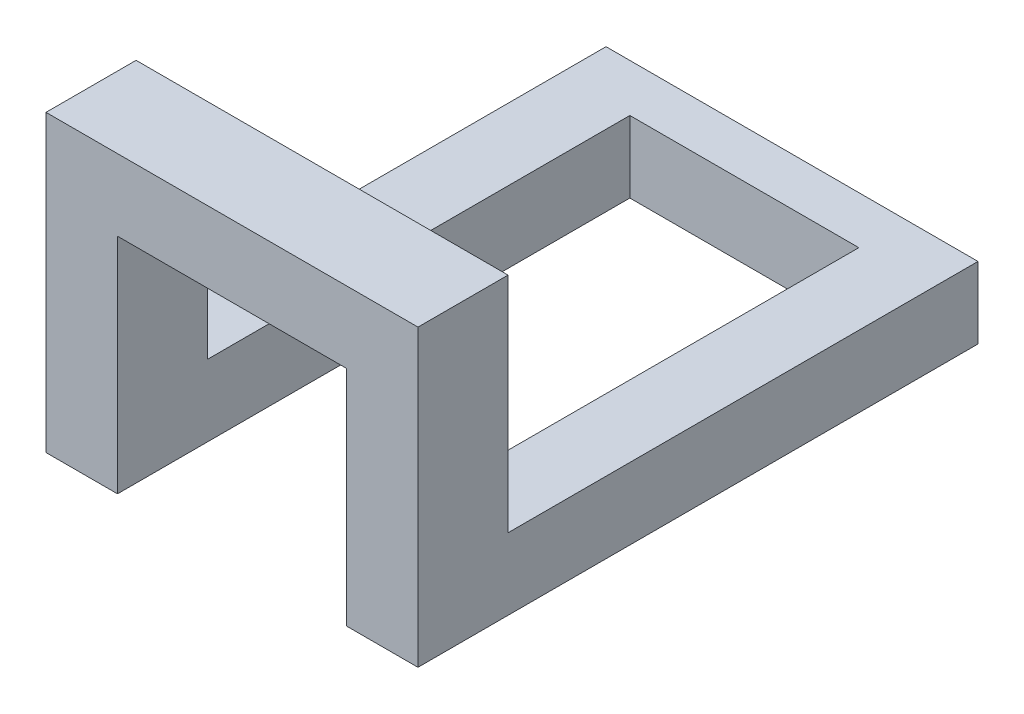
ISO-10303-21;
HEADER;
FILE_DESCRIPTION(('STEP AP214'),'2;1');
FILE_NAME('part.step','',(''),(''),'','','');
FILE_SCHEMA(('AUTOMOTIVE_DESIGN { 1 0 10303 214 1 1 1 1 }'));
ENDSEC;
DATA;
#1=APPLICATION_CONTEXT('core data for automotive mechanical design processes');
#2=APPLICATION_PROTOCOL_DEFINITION('international standard','automotive_design',2000,#1);
#3=PRODUCT_CONTEXT('',#1,'mechanical');
#4=PRODUCT('Part','Part','',(#3));
#5=PRODUCT_RELATED_PRODUCT_CATEGORY('part','',(#4));
#6=PRODUCT_DEFINITION_FORMATION('','',#4);
#7=PRODUCT_DEFINITION_CONTEXT('part definition',#1,'design');
#8=PRODUCT_DEFINITION('design','',#6,#7);
#9=PRODUCT_DEFINITION_SHAPE('','',#8);
#10=(LENGTH_UNIT() NAMED_UNIT(*) SI_UNIT(.MILLI.,.METRE.));
#11=(NAMED_UNIT(*) PLANE_ANGLE_UNIT() SI_UNIT($,.RADIAN.));
#12=(NAMED_UNIT(*) SI_UNIT($,.STERADIAN.) SOLID_ANGLE_UNIT());
#13=UNCERTAINTY_MEASURE_WITH_UNIT(LENGTH_MEASURE(1.E-05),#10,'distance_accuracy_value','');
#14=(GEOMETRIC_REPRESENTATION_CONTEXT(3) GLOBAL_UNCERTAINTY_ASSIGNED_CONTEXT((#13)) GLOBAL_UNIT_ASSIGNED_CONTEXT((#10,
#11,#12)) REPRESENTATION_CONTEXT('',''));
#15=CARTESIAN_POINT('',(0.,0.,0.));
#16=DIRECTION('',(0.,0.,1.));
#17=DIRECTION('',(1.,0.,0.));
#18=AXIS2_PLACEMENT_3D('',#15,#16,#17);
#19=CARTESIAN_POINT('',(24.4702529272949,3.81,-14.9470824608488));
#20=DIRECTION('',(0.,0.,-1.));
#21=DIRECTION('',(-1.,0.,0.));
#22=AXIS2_PLACEMENT_3D('',#19,#20,#21);
#23=PLANE('',#22);
#24=DIRECTION('',(0.,1.,0.));
#25=VECTOR('',#24,1.);
#26=CARTESIAN_POINT('',(28.2802529272949,-18.0183031909331,-14.9470824608488));
#27=LINE('',#26,#25);
#28=CARTESIAN_POINT('',(28.2802529272949,-8.08000000000004,-14.9470824608488));
#29=VERTEX_POINT('',#28);
#30=CARTESIAN_POINT('',(28.2802529272949,0.,-14.9470824608488));
#31=VERTEX_POINT('',#30);
#32=EDGE_CURVE('E195',#29,#31,#27,.T.);
#33=ORIENTED_EDGE('',*,*,#32,.F.);
#34=DIRECTION('',(1.,0.,0.));
#35=VECTOR('',#34,1.);
#36=CARTESIAN_POINT('',(28.2802529272949,-8.08000000000004,-14.9470824608488));
#37=LINE('',#36,#35);
#38=CARTESIAN_POINT('',(24.4702529272949,-8.08000000000004,-14.9470824608488));
#39=VERTEX_POINT('',#38);
#40=EDGE_CURVE('E162',#39,#29,#37,.T.);
#41=ORIENTED_EDGE('',*,*,#40,.F.);
#42=DIRECTION('',(0.,-1.,0.));
#43=VECTOR('',#42,1.);
#44=CARTESIAN_POINT('',(24.4702529272949,3.81,-14.9470824608488));
#45=LINE('',#44,#43);
#46=CARTESIAN_POINT('',(24.4702529272949,3.81,-14.9470824608488));
#47=VERTEX_POINT('',#46);
#48=EDGE_CURVE('E40',#47,#39,#45,.T.);
#49=ORIENTED_EDGE('',*,*,#48,.F.);
#50=DIRECTION('',(1.,0.,0.));
#51=VECTOR('',#50,1.);
#52=CARTESIAN_POINT('',(24.4702529272949,3.81,-14.9470824608488));
#53=LINE('',#52,#51);
#54=CARTESIAN_POINT('',(44.2902529272949,3.81,-14.9470824608488));
#55=VERTEX_POINT('',#54);
#56=EDGE_CURVE('E209',#47,#55,#53,.T.);
#57=ORIENTED_EDGE('',*,*,#56,.T.);
#58=DIRECTION('',(0.,-1.,0.));
#59=VECTOR('',#58,1.);
#60=CARTESIAN_POINT('',(44.2902529272949,3.81,-14.9470824608488));
#61=LINE('',#60,#59);
#62=CARTESIAN_POINT('',(44.2902529272949,-8.08000000000004,-14.9470824608488));
#63=VERTEX_POINT('',#62);
#64=EDGE_CURVE('E220',#55,#63,#61,.T.);
#65=ORIENTED_EDGE('',*,*,#64,.T.);
#66=DIRECTION('',(1.,0.,0.));
#67=VECTOR('',#66,1.);
#68=CARTESIAN_POINT('',(44.2902529272949,-8.08000000000004,-14.9470824608488));
#69=LINE('',#68,#67);
#70=CARTESIAN_POINT('',(40.4802529272949,-8.08000000000004,-14.9470824608488));
#71=VERTEX_POINT('',#70);
#72=EDGE_CURVE('E53',#71,#63,#69,.T.);
#73=ORIENTED_EDGE('',*,*,#72,.F.);
#74=DIRECTION('',(0.,1.,0.));
#75=VECTOR('',#74,1.);
#76=CARTESIAN_POINT('',(40.4802529272949,-18.0183031909331,-14.9470824608488));
#77=LINE('',#76,#75);
#78=CARTESIAN_POINT('',(40.4802529272949,0.,-14.9470824608488));
#79=VERTEX_POINT('',#78);
#80=EDGE_CURVE('E189',#71,#79,#77,.T.);
#81=ORIENTED_EDGE('',*,*,#80,.T.);
#82=DIRECTION('',(1.,0.,0.));
#83=VECTOR('',#82,1.);
#84=CARTESIAN_POINT('',(24.4702529272949,0.,-14.9470824608488));
#85=LINE('',#84,#83);
#86=EDGE_CURVE('E205',#31,#79,#85,.T.);
#87=ORIENTED_EDGE('',*,*,#86,.F.);
#88=EDGE_LOOP('',(#33,#41,#49,#57,#65,#73,#81,#87));
#89=FACE_BOUND('',#88,.T.);
#90=ADVANCED_FACE('F36',(#89),#23,.T.);
#91=CARTESIAN_POINT('',(0.,0.,0.));
#92=DIRECTION('',(0.,-1.,0.));
#93=DIRECTION('',(0.,0.,-1.));
#94=AXIS2_PLACEMENT_3D('',#91,#92,#93);
#95=PLANE('',#94);
#96=ORIENTED_EDGE('',*,*,#86,.T.);
#97=DIRECTION('',(0.,0.,-1.));
#98=VECTOR('',#97,1.);
#99=CARTESIAN_POINT('',(40.4802529272949,0.,-14.9470824608488));
#100=LINE('',#99,#98);
#101=CARTESIAN_POINT('',(40.4802529272949,0.,-10.1470824608488));
#102=VERTEX_POINT('',#101);
#103=EDGE_CURVE('E61',#102,#79,#100,.T.);
#104=ORIENTED_EDGE('',*,*,#103,.F.);
#105=DIRECTION('',(-1.,0.,0.));
#106=VECTOR('',#105,1.);
#107=CARTESIAN_POINT('',(44.2902529272949,0.,-10.1470824608488));
#108=LINE('',#107,#106);
#109=CARTESIAN_POINT('',(28.2802529272949,0.,-10.1470824608488));
#110=VERTEX_POINT('',#109);
#111=EDGE_CURVE('E210',#102,#110,#108,.T.);
#112=ORIENTED_EDGE('',*,*,#111,.T.);
#113=DIRECTION('',(0.,0.,1.));
#114=VECTOR('',#113,1.);
#115=CARTESIAN_POINT('',(28.2802529272949,0.,-10.1470824608488));
#116=LINE('',#115,#114);
#117=EDGE_CURVE('E136',#31,#110,#116,.T.);
#118=ORIENTED_EDGE('',*,*,#117,.F.);
#119=EDGE_LOOP('',(#96,#104,#112,#118));
#120=FACE_BOUND('',#119,.T.);
#121=ADVANCED_FACE('F240',(#120),#95,.T.);
#122=CARTESIAN_POINT('',(24.4702529272949,3.81,-10.1470824608488));
#123=DIRECTION('',(-1.,0.,0.));
#124=DIRECTION('',(0.,0.,1.));
#125=AXIS2_PLACEMENT_3D('',#122,#123,#124);
#126=PLANE('',#125);
#127=ORIENTED_EDGE('',*,*,#48,.T.);
#128=DIRECTION('',(0.,0.,1.));
#129=VECTOR('',#128,1.);
#130=CARTESIAN_POINT('',(24.4702529272949,-8.08000000000004,-42.8352361334903));
#131=LINE('',#130,#129);
#132=CARTESIAN_POINT('',(24.4702529272949,-8.08000000000004,-39.9870824608488));
#133=VERTEX_POINT('',#132);
#134=EDGE_CURVE('E168',#133,#39,#131,.T.);
#135=ORIENTED_EDGE('',*,*,#134,.F.);
#136=DIRECTION('',(0.,1.,0.));
#137=VECTOR('',#136,1.);
#138=CARTESIAN_POINT('',(24.4702529272949,-8.08000000000004,-39.9870824608488));
#139=LINE('',#138,#137);
#140=CARTESIAN_POINT('',(24.4702529272949,-11.89,-39.9870824608488));
#141=VERTEX_POINT('',#140);
#142=EDGE_CURVE('E148',#141,#133,#139,.T.);
#143=ORIENTED_EDGE('',*,*,#142,.F.);
#144=DIRECTION('',(0.,0.,-1.));
#145=VECTOR('',#144,1.);
#146=CARTESIAN_POINT('',(24.4702529272949,-11.89,-10.1470824608488));
#147=LINE('',#146,#145);
#148=CARTESIAN_POINT('',(24.4702529272949,-11.89,-10.1470824608488));
#149=VERTEX_POINT('',#148);
#150=EDGE_CURVE('E144',#149,#141,#147,.T.);
#151=ORIENTED_EDGE('',*,*,#150,.F.);
#152=DIRECTION('',(0.,-1.,0.));
#153=VECTOR('',#152,1.);
#154=CARTESIAN_POINT('',(24.4702529272949,3.81,-10.1470824608488));
#155=LINE('',#154,#153);
#156=CARTESIAN_POINT('',(24.4702529272949,3.81,-10.1470824608488));
#157=VERTEX_POINT('',#156);
#158=EDGE_CURVE('E11',#157,#149,#155,.T.);
#159=ORIENTED_EDGE('',*,*,#158,.F.);
#160=DIRECTION('',(0.,0.,-1.));
#161=VECTOR('',#160,1.);
#162=CARTESIAN_POINT('',(24.4702529272949,3.81,-10.1470824608488));
#163=LINE('',#162,#161);
#164=EDGE_CURVE('E206',#157,#47,#163,.T.);
#165=ORIENTED_EDGE('',*,*,#164,.T.);
#166=EDGE_LOOP('',(#127,#135,#143,#151,#159,#165));
#167=FACE_BOUND('',#166,.T.);
#168=ADVANCED_FACE('F38',(#167),#126,.T.);
#169=CARTESIAN_POINT('',(44.2902529272949,3.81,-10.1470824608488));
#170=DIRECTION('',(0.,0.,1.));
#171=DIRECTION('',(1.,0.,0.));
#172=AXIS2_PLACEMENT_3D('',#169,#170,#171);
#173=PLANE('',#172);
#174=ORIENTED_EDGE('',*,*,#111,.F.);
#175=DIRECTION('',(0.,1.,0.));
#176=VECTOR('',#175,1.);
#177=CARTESIAN_POINT('',(40.4802529272949,-18.0183031909331,-10.1470824608488));
#178=LINE('',#177,#176);
#179=CARTESIAN_POINT('',(40.4802529272949,-11.89,-10.1470824608488));
#180=VERTEX_POINT('',#179);
#181=EDGE_CURVE('E186',#180,#102,#178,.T.);
#182=ORIENTED_EDGE('',*,*,#181,.F.);
#183=DIRECTION('',(-1.,0.,0.));
#184=VECTOR('',#183,1.);
#185=CARTESIAN_POINT('',(44.2902529272949,-11.89,-10.1470824608488));
#186=LINE('',#185,#184);
#187=CARTESIAN_POINT('',(44.2902529272949,-11.89,-10.1470824608488));
#188=VERTEX_POINT('',#187);
#189=EDGE_CURVE('E137',#188,#180,#186,.T.);
#190=ORIENTED_EDGE('',*,*,#189,.F.);
#191=DIRECTION('',(0.,-1.,0.));
#192=VECTOR('',#191,1.);
#193=CARTESIAN_POINT('',(44.2902529272949,3.81,-10.1470824608488));
#194=LINE('',#193,#192);
#195=CARTESIAN_POINT('',(44.2902529272949,3.81,-10.1470824608488));
#196=VERTEX_POINT('',#195);
#197=EDGE_CURVE('E45',#196,#188,#194,.T.);
#198=ORIENTED_EDGE('',*,*,#197,.F.);
#199=DIRECTION('',(-1.,0.,0.));
#200=VECTOR('',#199,1.);
#201=CARTESIAN_POINT('',(44.2902529272949,3.81,-10.1470824608488));
#202=LINE('',#201,#200);
#203=EDGE_CURVE('E215',#196,#157,#202,.T.);
#204=ORIENTED_EDGE('',*,*,#203,.T.);
#205=ORIENTED_EDGE('',*,*,#158,.T.);
#206=DIRECTION('',(-1.,0.,0.));
#207=VECTOR('',#206,1.);
#208=CARTESIAN_POINT('',(24.4702529272949,-11.89,-10.1470824608488));
#209=LINE('',#208,#207);
#210=CARTESIAN_POINT('',(28.2802529272949,-11.89,-10.1470824608488));
#211=VERTEX_POINT('',#210);
#212=EDGE_CURVE('E197',#211,#149,#209,.T.);
#213=ORIENTED_EDGE('',*,*,#212,.F.);
#214=DIRECTION('',(0.,1.,0.));
#215=VECTOR('',#214,1.);
#216=CARTESIAN_POINT('',(28.2802529272949,-18.0183031909331,-10.1470824608488));
#217=LINE('',#216,#215);
#218=EDGE_CURVE('E200',#211,#110,#217,.T.);
#219=ORIENTED_EDGE('',*,*,#218,.T.);
#220=EDGE_LOOP('',(#174,#182,#190,#198,#204,#205,#213,#219));
#221=FACE_BOUND('',#220,.T.);
#222=ADVANCED_FACE('F250',(#221),#173,.T.);
#223=CARTESIAN_POINT('',(44.2902529272949,3.81,-10.1470824608488));
#224=DIRECTION('',(-1.,0.,0.));
#225=DIRECTION('',(0.,0.,1.));
#226=AXIS2_PLACEMENT_3D('',#223,#224,#225);
#227=PLANE('',#226);
#228=ORIENTED_EDGE('',*,*,#197,.T.);
#229=DIRECTION('',(0.,0.,1.));
#230=VECTOR('',#229,1.);
#231=CARTESIAN_POINT('',(44.2902529272949,-11.89,-14.9470824608488));
#232=LINE('',#231,#230);
#233=CARTESIAN_POINT('',(44.2902529272949,-11.89,-39.9870824608488));
#234=VERTEX_POINT('',#233);
#235=EDGE_CURVE('E127',#234,#188,#232,.T.);
#236=ORIENTED_EDGE('',*,*,#235,.F.);
#237=DIRECTION('',(0.,-1.,0.));
#238=VECTOR('',#237,1.);
#239=CARTESIAN_POINT('',(44.2902529272949,-8.08000000000004,-39.9870824608488));
#240=LINE('',#239,#238);
#241=CARTESIAN_POINT('',(44.2902529272949,-8.08000000000004,-39.9870824608488));
#242=VERTEX_POINT('',#241);
#243=EDGE_CURVE('E132',#242,#234,#240,.T.);
#244=ORIENTED_EDGE('',*,*,#243,.F.);
#245=DIRECTION('',(0.,0.,1.));
#246=VECTOR('',#245,1.);
#247=CARTESIAN_POINT('',(44.2902529272949,-8.08000000000004,-42.8352361334903));
#248=LINE('',#247,#246);
#249=EDGE_CURVE('E179',#242,#63,#248,.T.);
#250=ORIENTED_EDGE('',*,*,#249,.T.);
#251=ORIENTED_EDGE('',*,*,#64,.F.);
#252=DIRECTION('',(0.,0.,-1.));
#253=VECTOR('',#252,1.);
#254=CARTESIAN_POINT('',(44.2902529272949,3.81,-10.1470824608488));
#255=LINE('',#254,#253);
#256=EDGE_CURVE('E213',#196,#55,#255,.T.);
#257=ORIENTED_EDGE('',*,*,#256,.F.);
#258=EDGE_LOOP('',(#228,#236,#244,#250,#251,#257));
#259=FACE_BOUND('',#258,.T.);
#260=ADVANCED_FACE('F129',(#259),#227,.F.);
#261=CARTESIAN_POINT('',(0.,3.81,0.));
#262=DIRECTION('',(0.,-1.,0.));
#263=DIRECTION('',(0.,0.,-1.));
#264=AXIS2_PLACEMENT_3D('',#261,#262,#263);
#265=PLANE('',#264);
#266=ORIENTED_EDGE('',*,*,#164,.F.);
#267=ORIENTED_EDGE('',*,*,#203,.F.);
#268=ORIENTED_EDGE('',*,*,#256,.T.);
#269=ORIENTED_EDGE('',*,*,#56,.F.);
#270=EDGE_LOOP('',(#266,#267,#268,#269));
#271=FACE_BOUND('',#270,.T.);
#272=ADVANCED_FACE('F229',(#271),#265,.F.);
#273=CARTESIAN_POINT('',(28.2802529272949,-18.0183031909331,-10.1470824608488));
#274=DIRECTION('',(-1.,0.,0.));
#275=DIRECTION('',(0.,0.,1.));
#276=AXIS2_PLACEMENT_3D('',#273,#274,#275);
#277=PLANE('',#276);
#278=DIRECTION('',(0.,0.,1.));
#279=VECTOR('',#278,1.);
#280=CARTESIAN_POINT('',(28.2802529272949,-11.89,-10.1470824608488));
#281=LINE('',#280,#279);
#282=CARTESIAN_POINT('',(28.2802529272949,-11.89,-37.4470824608488));
#283=VERTEX_POINT('',#282);
#284=EDGE_CURVE('E193',#283,#211,#281,.T.);
#285=ORIENTED_EDGE('',*,*,#284,.F.);
#286=DIRECTION('',(0.,1.,0.));
#287=VECTOR('',#286,1.);
#288=CARTESIAN_POINT('',(28.2802529272949,-11.89,-37.4470824608488));
#289=LINE('',#288,#287);
#290=CARTESIAN_POINT('',(28.2802529272949,-8.08000000000004,-37.4470824608488));
#291=VERTEX_POINT('',#290);
#292=EDGE_CURVE('E165',#283,#291,#289,.T.);
#293=ORIENTED_EDGE('',*,*,#292,.T.);
#294=DIRECTION('',(0.,0.,1.));
#295=VECTOR('',#294,1.);
#296=CARTESIAN_POINT('',(28.2802529272949,-8.08000000000004,-42.8352361334903));
#297=LINE('',#296,#295);
#298=EDGE_CURVE('E171',#291,#29,#297,.T.);
#299=ORIENTED_EDGE('',*,*,#298,.T.);
#300=ORIENTED_EDGE('',*,*,#32,.T.);
#301=ORIENTED_EDGE('',*,*,#117,.T.);
#302=ORIENTED_EDGE('',*,*,#218,.F.);
#303=EDGE_LOOP('',(#285,#293,#299,#300,#301,#302));
#304=FACE_BOUND('',#303,.T.);
#305=ADVANCED_FACE('F244',(#304),#277,.F.);
#306=CARTESIAN_POINT('',(72.9389097707494,-11.89,62.6455788901272));
#307=DIRECTION('',(0.,-1.,0.));
#308=DIRECTION('',(0.,0.,-1.));
#309=AXIS2_PLACEMENT_3D('',#306,#307,#308);
#310=PLANE('',#309);
#311=ORIENTED_EDGE('',*,*,#150,.T.);
#312=DIRECTION('',(-1.,0.,0.));
#313=VECTOR('',#312,1.);
#314=CARTESIAN_POINT('',(44.2902529272949,-11.89,-39.9870824608488));
#315=LINE('',#314,#313);
#316=EDGE_CURVE('E140',#234,#141,#315,.T.);
#317=ORIENTED_EDGE('',*,*,#316,.F.);
#318=ORIENTED_EDGE('',*,*,#235,.T.);
#319=ORIENTED_EDGE('',*,*,#189,.T.);
#320=DIRECTION('',(0.,0.,-1.));
#321=VECTOR('',#320,1.);
#322=CARTESIAN_POINT('',(40.4802529272949,-11.89,-14.9470824608488));
#323=LINE('',#322,#321);
#324=CARTESIAN_POINT('',(40.4802529272949,-11.89,-37.4470824608488));
#325=VERTEX_POINT('',#324);
#326=EDGE_CURVE('E183',#180,#325,#323,.T.);
#327=ORIENTED_EDGE('',*,*,#326,.T.);
#328=DIRECTION('',(-1.,0.,0.));
#329=VECTOR('',#328,1.);
#330=CARTESIAN_POINT('',(44.2902529272949,-11.89,-37.4470824608488));
#331=LINE('',#330,#329);
#332=EDGE_CURVE('E157',#325,#283,#331,.T.);
#333=ORIENTED_EDGE('',*,*,#332,.T.);
#334=ORIENTED_EDGE('',*,*,#284,.T.);
#335=ORIENTED_EDGE('',*,*,#212,.T.);
#336=EDGE_LOOP('',(#311,#317,#318,#319,#327,#333,#334,#335));
#337=FACE_BOUND('',#336,.T.);
#338=ADVANCED_FACE('F141',(#337),#310,.T.);
#339=CARTESIAN_POINT('',(40.4802529272949,-18.0183031909331,-14.9470824608488));
#340=DIRECTION('',(1.,0.,0.));
#341=DIRECTION('',(0.,0.,-1.));
#342=AXIS2_PLACEMENT_3D('',#339,#340,#341);
#343=PLANE('',#342);
#344=ORIENTED_EDGE('',*,*,#326,.F.);
#345=ORIENTED_EDGE('',*,*,#181,.T.);
#346=ORIENTED_EDGE('',*,*,#103,.T.);
#347=ORIENTED_EDGE('',*,*,#80,.F.);
#348=DIRECTION('',(0.,0.,1.));
#349=VECTOR('',#348,1.);
#350=CARTESIAN_POINT('',(40.4802529272949,-8.08000000000004,-42.8352361334903));
#351=LINE('',#350,#349);
#352=CARTESIAN_POINT('',(40.4802529272949,-8.08000000000004,-37.4470824608488));
#353=VERTEX_POINT('',#352);
#354=EDGE_CURVE('E177',#353,#71,#351,.T.);
#355=ORIENTED_EDGE('',*,*,#354,.F.);
#356=DIRECTION('',(0.,-1.,0.));
#357=VECTOR('',#356,1.);
#358=CARTESIAN_POINT('',(40.4802529272949,-11.89,-37.4470824608488));
#359=LINE('',#358,#357);
#360=EDGE_CURVE('E174',#353,#325,#359,.T.);
#361=ORIENTED_EDGE('',*,*,#360,.T.);
#362=EDGE_LOOP('',(#344,#345,#346,#347,#355,#361));
#363=FACE_BOUND('',#362,.T.);
#364=ADVANCED_FACE('F237',(#363),#343,.F.);
#365=CARTESIAN_POINT('',(44.2902529272949,-8.08000000000004,-42.8352361334903));
#366=DIRECTION('',(0.,-1.,0.));
#367=DIRECTION('',(0.,0.,-1.));
#368=AXIS2_PLACEMENT_3D('',#365,#366,#367);
#369=PLANE('',#368);
#370=ORIENTED_EDGE('',*,*,#249,.F.);
#371=DIRECTION('',(1.,0.,0.));
#372=VECTOR('',#371,1.);
#373=CARTESIAN_POINT('',(44.2902529272949,-8.08000000000004,-39.9870824608488));
#374=LINE('',#373,#372);
#375=EDGE_CURVE('E153',#133,#242,#374,.T.);
#376=ORIENTED_EDGE('',*,*,#375,.F.);
#377=ORIENTED_EDGE('',*,*,#134,.T.);
#378=ORIENTED_EDGE('',*,*,#40,.T.);
#379=ORIENTED_EDGE('',*,*,#298,.F.);
#380=DIRECTION('',(1.,0.,0.));
#381=VECTOR('',#380,1.);
#382=CARTESIAN_POINT('',(44.2902529272949,-8.08000000000004,-37.4470824608488));
#383=LINE('',#382,#381);
#384=EDGE_CURVE('E154',#291,#353,#383,.T.);
#385=ORIENTED_EDGE('',*,*,#384,.T.);
#386=ORIENTED_EDGE('',*,*,#354,.T.);
#387=ORIENTED_EDGE('',*,*,#72,.T.);
#388=EDGE_LOOP('',(#370,#376,#377,#378,#379,#385,#386,#387));
#389=FACE_BOUND('',#388,.T.);
#390=ADVANCED_FACE('F232',(#389),#369,.F.);
#391=CARTESIAN_POINT('',(0.,0.,-39.9870824608488));
#392=DIRECTION('',(0.,0.,-1.));
#393=DIRECTION('',(-1.,0.,0.));
#394=AXIS2_PLACEMENT_3D('',#391,#392,#393);
#395=PLANE('',#394);
#396=ORIENTED_EDGE('',*,*,#243,.T.);
#397=ORIENTED_EDGE('',*,*,#316,.T.);
#398=ORIENTED_EDGE('',*,*,#142,.T.);
#399=ORIENTED_EDGE('',*,*,#375,.T.);
#400=EDGE_LOOP('',(#396,#397,#398,#399));
#401=FACE_BOUND('',#400,.T.);
#402=ADVANCED_FACE('F151',(#401),#395,.T.);
#403=CARTESIAN_POINT('',(0.,0.,-37.4470824608488));
#404=DIRECTION('',(0.,0.,-1.));
#405=DIRECTION('',(-1.,0.,0.));
#406=AXIS2_PLACEMENT_3D('',#403,#404,#405);
#407=PLANE('',#406);
#408=ORIENTED_EDGE('',*,*,#360,.F.);
#409=ORIENTED_EDGE('',*,*,#384,.F.);
#410=ORIENTED_EDGE('',*,*,#292,.F.);
#411=ORIENTED_EDGE('',*,*,#332,.F.);
#412=EDGE_LOOP('',(#408,#409,#410,#411));
#413=FACE_BOUND('',#412,.T.);
#414=ADVANCED_FACE('F247',(#413),#407,.F.);
#415=CLOSED_SHELL('',(#90,#121,#168,#222,#260,#272,#305,#338,#364,#390,#402,#414));
#416=MANIFOLD_SOLID_BREP('B2',#415);
#417=ADVANCED_BREP_SHAPE_REPRESENTATION('',(#18,#416),#14);
#418=SHAPE_DEFINITION_REPRESENTATION(#9,#417);
ENDSEC;
END-ISO-10303-21;
